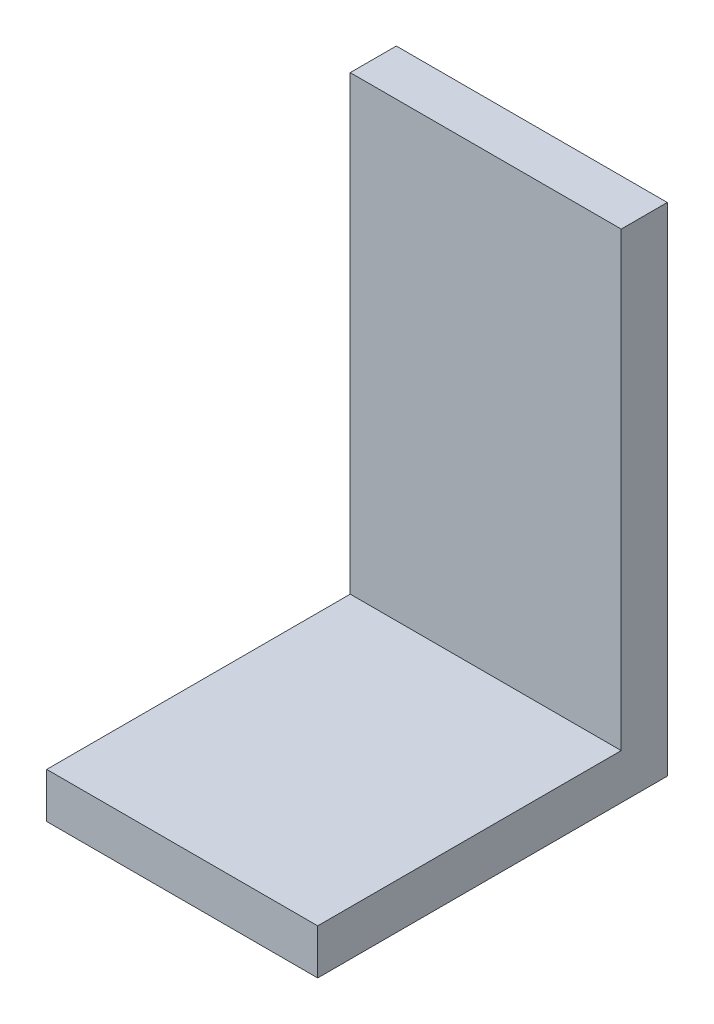
ISO-10303-21;
HEADER;
FILE_DESCRIPTION(('STEP AP214'),'2;1');
FILE_NAME('part.step','',(''),(''),'','','');
FILE_SCHEMA(('AUTOMOTIVE_DESIGN { 1 0 10303 214 1 1 1 1 }'));
ENDSEC;
DATA;
#1=APPLICATION_CONTEXT('core data for automotive mechanical design processes');
#2=APPLICATION_PROTOCOL_DEFINITION('international standard','automotive_design',2000,#1);
#3=PRODUCT_CONTEXT('',#1,'mechanical');
#4=PRODUCT('Part','Part','',(#3));
#5=PRODUCT_RELATED_PRODUCT_CATEGORY('part','',(#4));
#6=PRODUCT_DEFINITION_FORMATION('','',#4);
#7=PRODUCT_DEFINITION_CONTEXT('part definition',#1,'design');
#8=PRODUCT_DEFINITION('design','',#6,#7);
#9=PRODUCT_DEFINITION_SHAPE('','',#8);
#10=(LENGTH_UNIT() NAMED_UNIT(*) SI_UNIT(.MILLI.,.METRE.));
#11=(NAMED_UNIT(*) PLANE_ANGLE_UNIT() SI_UNIT($,.RADIAN.));
#12=(NAMED_UNIT(*) SI_UNIT($,.STERADIAN.) SOLID_ANGLE_UNIT());
#13=UNCERTAINTY_MEASURE_WITH_UNIT(LENGTH_MEASURE(1.E-05),#10,'distance_accuracy_value','');
#14=(GEOMETRIC_REPRESENTATION_CONTEXT(3) GLOBAL_UNCERTAINTY_ASSIGNED_CONTEXT((#13)) GLOBAL_UNIT_ASSIGNED_CONTEXT((#10,
#11,#12)) REPRESENTATION_CONTEXT('',''));
#15=CARTESIAN_POINT('',(0.,0.,0.));
#16=DIRECTION('',(0.,0.,1.));
#17=DIRECTION('',(1.,0.,0.));
#18=AXIS2_PLACEMENT_3D('',#15,#16,#17);
#19=CARTESIAN_POINT('',(-2.6,-4.55,0.));
#20=DIRECTION('',(1.,0.,0.));
#21=DIRECTION('',(0.,0.,1.));
#22=AXIS2_PLACEMENT_3D('',#19,#20,#21);
#23=PLANE('',#22);
#24=DIRECTION('',(0.,-1.,0.));
#25=VECTOR('',#24,1.);
#26=CARTESIAN_POINT('',(-2.6,-4.,0.));
#27=LINE('',#26,#25);
#28=CARTESIAN_POINT('',(-2.6,-4.,0.));
#29=VERTEX_POINT('',#28);
#30=CARTESIAN_POINT('',(-2.6,-4.55,0.));
#31=VERTEX_POINT('',#30);
#32=EDGE_CURVE('E11',#29,#31,#27,.T.);
#33=ORIENTED_EDGE('',*,*,#32,.F.);
#34=DIRECTION('',(0.,0.,-1.));
#35=VECTOR('',#34,1.);
#36=CARTESIAN_POINT('',(-2.6,-4.,0.051));
#37=LINE('',#36,#35);
#38=CARTESIAN_POINT('',(-2.6,-4.,0.051));
#39=VERTEX_POINT('',#38);
#40=EDGE_CURVE('E24',#39,#29,#37,.T.);
#41=ORIENTED_EDGE('',*,*,#40,.F.);
#42=DIRECTION('',(0.,1.,0.));
#43=VECTOR('',#42,1.);
#44=CARTESIAN_POINT('',(-2.6,-4.5,0.051));
#45=LINE('',#44,#43);
#46=CARTESIAN_POINT('',(-2.6,-4.5,0.051));
#47=VERTEX_POINT('',#46);
#48=EDGE_CURVE('E87',#47,#39,#45,.T.);
#49=ORIENTED_EDGE('',*,*,#48,.F.);
#50=DIRECTION('',(0.,0.,-1.));
#51=VECTOR('',#50,1.);
#52=CARTESIAN_POINT('',(-2.6,-4.5,0.387));
#53=LINE('',#52,#51);
#54=CARTESIAN_POINT('',(-2.6,-4.5,0.387));
#55=VERTEX_POINT('',#54);
#56=EDGE_CURVE('E114',#55,#47,#53,.T.);
#57=ORIENTED_EDGE('',*,*,#56,.F.);
#58=DIRECTION('',(0.,1.,0.));
#59=VECTOR('',#58,1.);
#60=CARTESIAN_POINT('',(-2.6,-4.55,0.387));
#61=LINE('',#60,#59);
#62=CARTESIAN_POINT('',(-2.6,-4.55,0.387));
#63=VERTEX_POINT('',#62);
#64=EDGE_CURVE('E111',#63,#55,#61,.T.);
#65=ORIENTED_EDGE('',*,*,#64,.F.);
#66=DIRECTION('',(0.,0.,1.));
#67=VECTOR('',#66,1.);
#68=CARTESIAN_POINT('',(-2.6,-4.55,0.));
#69=LINE('',#68,#67);
#70=EDGE_CURVE('E108',#31,#63,#69,.T.);
#71=ORIENTED_EDGE('',*,*,#70,.F.);
#72=EDGE_LOOP('',(#33,#41,#49,#57,#65,#71));
#73=FACE_BOUND('',#72,.T.);
#74=ADVANCED_FACE('F17',(#73),#23,.T.);
#75=CARTESIAN_POINT('',(-2.9,-4.,0.));
#76=DIRECTION('',(-1.,0.,0.));
#77=DIRECTION('',(0.,0.,1.));
#78=AXIS2_PLACEMENT_3D('',#75,#76,#77);
#79=PLANE('',#78);
#80=DIRECTION('',(0.,1.,0.));
#81=VECTOR('',#80,1.);
#82=CARTESIAN_POINT('',(-2.9,-4.55,0.));
#83=LINE('',#82,#81);
#84=CARTESIAN_POINT('',(-2.9,-4.55,0.));
#85=VERTEX_POINT('',#84);
#86=CARTESIAN_POINT('',(-2.9,-4.,0.));
#87=VERTEX_POINT('',#86);
#88=EDGE_CURVE('E106',#85,#87,#83,.T.);
#89=ORIENTED_EDGE('',*,*,#88,.F.);
#90=DIRECTION('',(0.,0.,-1.));
#91=VECTOR('',#90,1.);
#92=CARTESIAN_POINT('',(-2.9,-4.55,0.387));
#93=LINE('',#92,#91);
#94=CARTESIAN_POINT('',(-2.9,-4.55,0.387));
#95=VERTEX_POINT('',#94);
#96=EDGE_CURVE('E103',#95,#85,#93,.T.);
#97=ORIENTED_EDGE('',*,*,#96,.F.);
#98=DIRECTION('',(0.,-1.,0.));
#99=VECTOR('',#98,1.);
#100=CARTESIAN_POINT('',(-2.9,-4.5,0.387));
#101=LINE('',#100,#99);
#102=CARTESIAN_POINT('',(-2.9,-4.5,0.387));
#103=VERTEX_POINT('',#102);
#104=EDGE_CURVE('E100',#103,#95,#101,.T.);
#105=ORIENTED_EDGE('',*,*,#104,.F.);
#106=DIRECTION('',(0.,0.,1.));
#107=VECTOR('',#106,1.);
#108=CARTESIAN_POINT('',(-2.9,-4.5,0.051));
#109=LINE('',#108,#107);
#110=CARTESIAN_POINT('',(-2.9,-4.5,0.051));
#111=VERTEX_POINT('',#110);
#112=EDGE_CURVE('E72',#111,#103,#109,.T.);
#113=ORIENTED_EDGE('',*,*,#112,.F.);
#114=DIRECTION('',(0.,-1.,0.));
#115=VECTOR('',#114,1.);
#116=CARTESIAN_POINT('',(-2.9,-4.,0.051));
#117=LINE('',#116,#115);
#118=CARTESIAN_POINT('',(-2.9,-4.,0.051));
#119=VERTEX_POINT('',#118);
#120=EDGE_CURVE('E66',#119,#111,#117,.T.);
#121=ORIENTED_EDGE('',*,*,#120,.F.);
#122=DIRECTION('',(0.,0.,1.));
#123=VECTOR('',#122,1.);
#124=CARTESIAN_POINT('',(-2.9,-4.,0.));
#125=LINE('',#124,#123);
#126=EDGE_CURVE('E69',#87,#119,#125,.T.);
#127=ORIENTED_EDGE('',*,*,#126,.F.);
#128=EDGE_LOOP('',(#89,#97,#105,#113,#121,#127));
#129=FACE_BOUND('',#128,.T.);
#130=ADVANCED_FACE('F68',(#129),#79,.T.);
#131=CARTESIAN_POINT('',(-2.6,-4.55,0.387));
#132=DIRECTION('',(0.,0.,1.));
#133=DIRECTION('',(0.,1.,0.));
#134=AXIS2_PLACEMENT_3D('',#131,#132,#133);
#135=PLANE('',#134);
#136=ORIENTED_EDGE('',*,*,#64,.T.);
#137=DIRECTION('',(1.,0.,0.));
#138=VECTOR('',#137,1.);
#139=CARTESIAN_POINT('',(-2.9,-4.5,0.387));
#140=LINE('',#139,#138);
#141=EDGE_CURVE('E83',#103,#55,#140,.T.);
#142=ORIENTED_EDGE('',*,*,#141,.F.);
#143=ORIENTED_EDGE('',*,*,#104,.T.);
#144=DIRECTION('',(-1.,0.,0.));
#145=VECTOR('',#144,1.);
#146=CARTESIAN_POINT('',(-2.6,-4.55,0.387));
#147=LINE('',#146,#145);
#148=EDGE_CURVE('E88',#63,#95,#147,.T.);
#149=ORIENTED_EDGE('',*,*,#148,.F.);
#150=EDGE_LOOP('',(#136,#142,#143,#149));
#151=FACE_BOUND('',#150,.T.);
#152=ADVANCED_FACE('F125',(#151),#135,.T.);
#153=CARTESIAN_POINT('',(-2.6,-4.5,0.051));
#154=DIRECTION('',(0.,0.,1.));
#155=DIRECTION('',(0.,1.,0.));
#156=AXIS2_PLACEMENT_3D('',#153,#154,#155);
#157=PLANE('',#156);
#158=ORIENTED_EDGE('',*,*,#48,.T.);
#159=DIRECTION('',(1.,0.,0.));
#160=VECTOR('',#159,1.);
#161=CARTESIAN_POINT('',(-2.9,-4.,0.051));
#162=LINE('',#161,#160);
#163=EDGE_CURVE('E81',#119,#39,#162,.T.);
#164=ORIENTED_EDGE('',*,*,#163,.F.);
#165=ORIENTED_EDGE('',*,*,#120,.T.);
#166=DIRECTION('',(-1.,0.,0.));
#167=VECTOR('',#166,1.);
#168=CARTESIAN_POINT('',(-2.6,-4.5,0.051));
#169=LINE('',#168,#167);
#170=EDGE_CURVE('E89',#47,#111,#169,.T.);
#171=ORIENTED_EDGE('',*,*,#170,.F.);
#172=EDGE_LOOP('',(#158,#164,#165,#171));
#173=FACE_BOUND('',#172,.T.);
#174=ADVANCED_FACE('F86',(#173),#157,.T.);
#175=CARTESIAN_POINT('',(-2.9,-4.55,0.));
#176=DIRECTION('',(0.,-1.,0.));
#177=DIRECTION('',(0.,0.,1.));
#178=AXIS2_PLACEMENT_3D('',#175,#176,#177);
#179=PLANE('',#178);
#180=DIRECTION('',(-1.,0.,0.));
#181=VECTOR('',#180,1.);
#182=CARTESIAN_POINT('',(-2.6,-4.55,0.));
#183=LINE('',#182,#181);
#184=EDGE_CURVE('E93',#31,#85,#183,.T.);
#185=ORIENTED_EDGE('',*,*,#184,.F.);
#186=ORIENTED_EDGE('',*,*,#70,.T.);
#187=ORIENTED_EDGE('',*,*,#148,.T.);
#188=ORIENTED_EDGE('',*,*,#96,.T.);
#189=EDGE_LOOP('',(#185,#186,#187,#188));
#190=FACE_BOUND('',#189,.T.);
#191=ADVANCED_FACE('F121',(#190),#179,.T.);
#192=CARTESIAN_POINT('',(-2.6,-4.,0.));
#193=DIRECTION('',(0.,1.,0.));
#194=DIRECTION('',(0.,0.,1.));
#195=AXIS2_PLACEMENT_3D('',#192,#193,#194);
#196=PLANE('',#195);
#197=DIRECTION('',(1.,0.,0.));
#198=VECTOR('',#197,1.);
#199=CARTESIAN_POINT('',(-2.9,-4.,0.));
#200=LINE('',#199,#198);
#201=EDGE_CURVE('E82',#87,#29,#200,.T.);
#202=ORIENTED_EDGE('',*,*,#201,.F.);
#203=ORIENTED_EDGE('',*,*,#126,.T.);
#204=ORIENTED_EDGE('',*,*,#163,.T.);
#205=ORIENTED_EDGE('',*,*,#40,.T.);
#206=EDGE_LOOP('',(#202,#203,#204,#205));
#207=FACE_BOUND('',#206,.T.);
#208=ADVANCED_FACE('F80',(#207),#196,.T.);
#209=CARTESIAN_POINT('',(-2.6,-4.5,0.051));
#210=DIRECTION('',(0.,1.,0.));
#211=DIRECTION('',(0.,0.,1.));
#212=AXIS2_PLACEMENT_3D('',#209,#210,#211);
#213=PLANE('',#212);
#214=ORIENTED_EDGE('',*,*,#170,.T.);
#215=ORIENTED_EDGE('',*,*,#112,.T.);
#216=ORIENTED_EDGE('',*,*,#141,.T.);
#217=ORIENTED_EDGE('',*,*,#56,.T.);
#218=EDGE_LOOP('',(#214,#215,#216,#217));
#219=FACE_BOUND('',#218,.T.);
#220=ADVANCED_FACE('F127',(#219),#213,.T.);
#221=CARTESIAN_POINT('',(-2.9,-4.55,0.));
#222=DIRECTION('',(0.,0.,-1.));
#223=DIRECTION('',(0.,1.,0.));
#224=AXIS2_PLACEMENT_3D('',#221,#222,#223);
#225=PLANE('',#224);
#226=ORIENTED_EDGE('',*,*,#88,.T.);
#227=ORIENTED_EDGE('',*,*,#201,.T.);
#228=ORIENTED_EDGE('',*,*,#32,.T.);
#229=ORIENTED_EDGE('',*,*,#184,.T.);
#230=EDGE_LOOP('',(#226,#227,#228,#229));
#231=FACE_BOUND('',#230,.T.);
#232=ADVANCED_FACE('F117',(#231),#225,.T.);
#233=CLOSED_SHELL('',(#74,#130,#152,#174,#191,#208,#220,#232));
#234=MANIFOLD_SOLID_BREP('B1',#233);
#235=ADVANCED_BREP_SHAPE_REPRESENTATION('',(#18,#234),#14);
#236=SHAPE_DEFINITION_REPRESENTATION(#9,#235);
ENDSEC;
END-ISO-10303-21;
